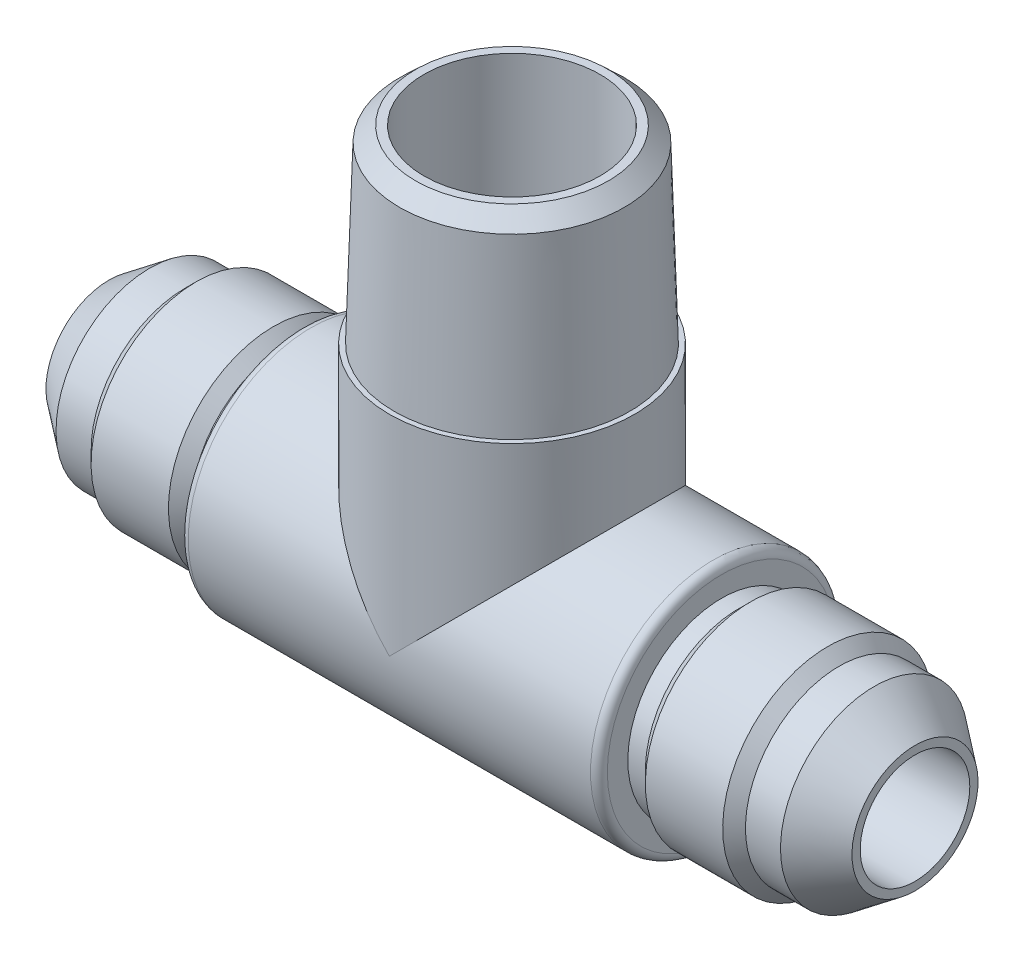
ISO-10303-21;
HEADER;
FILE_DESCRIPTION(('STEP AP214'),'2;1');
FILE_NAME('part.step','',(''),(''),'','','');
FILE_SCHEMA(('AUTOMOTIVE_DESIGN { 1 0 10303 214 1 1 1 1 }'));
ENDSEC;
DATA;
#1=APPLICATION_CONTEXT('core data for automotive mechanical design processes');
#2=APPLICATION_PROTOCOL_DEFINITION('international standard','automotive_design',2000,#1);
#3=PRODUCT_CONTEXT('',#1,'mechanical');
#4=PRODUCT('Part','Part','',(#3));
#5=PRODUCT_RELATED_PRODUCT_CATEGORY('part','',(#4));
#6=PRODUCT_DEFINITION_FORMATION('','',#4);
#7=PRODUCT_DEFINITION_CONTEXT('part definition',#1,'design');
#8=PRODUCT_DEFINITION('design','',#6,#7);
#9=PRODUCT_DEFINITION_SHAPE('','',#8);
#10=(LENGTH_UNIT() NAMED_UNIT(*) SI_UNIT(.MILLI.,.METRE.));
#11=(NAMED_UNIT(*) PLANE_ANGLE_UNIT() SI_UNIT($,.RADIAN.));
#12=(NAMED_UNIT(*) SI_UNIT($,.STERADIAN.) SOLID_ANGLE_UNIT());
#13=UNCERTAINTY_MEASURE_WITH_UNIT(LENGTH_MEASURE(1.E-05),#10,'distance_accuracy_value','');
#14=(GEOMETRIC_REPRESENTATION_CONTEXT(3) GLOBAL_UNCERTAINTY_ASSIGNED_CONTEXT((#13)) GLOBAL_UNIT_ASSIGNED_CONTEXT((#10,
#11,#12)) REPRESENTATION_CONTEXT('',''));
#15=CARTESIAN_POINT('',(0.,0.,0.));
#16=DIRECTION('',(0.,0.,1.));
#17=DIRECTION('',(1.,0.,0.));
#18=AXIS2_PLACEMENT_3D('',#15,#16,#17);
#19=CARTESIAN_POINT('',(-36.5125,0.,0.));
#20=DIRECTION('',(1.,0.,0.));
#21=DIRECTION('',(0.,0.,-1.));
#22=AXIS2_PLACEMENT_3D('',#19,#20,#21);
#23=CYLINDRICAL_SURFACE('',#22,4.9657);
#24=CARTESIAN_POINT('',(36.5125,-2.5496542476902E-13,0.));
#25=DIRECTION('',(-1.,0.,0.));
#26=DIRECTION('',(0.,0.,-1.));
#27=AXIS2_PLACEMENT_3D('',#24,#25,#26);
#28=CIRCLE('',#27,4.9657);
#29=CARTESIAN_POINT('',(36.5125,-2.5496542476902E-13,-4.9657));
#30=VERTEX_POINT('',#29);
#31=EDGE_CURVE('E71',#30,#30,#28,.T.);
#32=ORIENTED_EDGE('',*,*,#31,.F.);
#33=EDGE_LOOP('',(#32));
#34=FACE_BOUND('',#33,.T.);
#35=CARTESIAN_POINT('',(-36.5125,0.,0.));
#36=DIRECTION('',(1.,0.,0.));
#37=DIRECTION('',(0.,0.,-1.));
#38=AXIS2_PLACEMENT_3D('',#35,#36,#37);
#39=CIRCLE('',#38,4.9657);
#40=CARTESIAN_POINT('',(-36.5125,0.,-4.9657));
#41=VERTEX_POINT('',#40);
#42=EDGE_CURVE('E124',#41,#41,#39,.T.);
#43=ORIENTED_EDGE('',*,*,#42,.F.);
#44=EDGE_LOOP('',(#43));
#45=FACE_BOUND('',#44,.T.);
#46=CARTESIAN_POINT('',(0.,0.,0.));
#47=DIRECTION('',(0.707106781186547,-0.707106781186547,0.));
#48=DIRECTION('',(0.707106781186547,0.707106781186547,0.));
#49=AXIS2_PLACEMENT_3D('',#46,#47,#48);
#50=ELLIPSE('',#49,7.02256028667608,4.9657);
#51=CARTESIAN_POINT('',(0.,0.,-4.9657));
#52=VERTEX_POINT('',#51);
#53=CARTESIAN_POINT('',(0.,0.,4.9657));
#54=VERTEX_POINT('',#53);
#55=EDGE_CURVE('E55',#52,#54,#50,.T.);
#56=ORIENTED_EDGE('',*,*,#55,.F.);
#57=CARTESIAN_POINT('',(0.,0.,0.));
#58=DIRECTION('',(0.707106781186547,0.707106781186547,0.));
#59=DIRECTION('',(0.707106781186547,-0.707106781186547,0.));
#60=AXIS2_PLACEMENT_3D('',#57,#58,#59);
#61=ELLIPSE('',#60,7.02256028667608,4.9657);
#62=EDGE_CURVE('E67',#54,#52,#61,.F.);
#63=ORIENTED_EDGE('',*,*,#62,.F.);
#64=EDGE_LOOP('',(#56,#63));
#65=FACE_BOUND('',#64,.T.);
#66=ADVANCED_FACE('F40',(#34,#45,#65),#23,.F.);
#67=CARTESIAN_POINT('',(0.,18.9865,0.));
#68=DIRECTION('',(0.,1.,0.));
#69=DIRECTION('',(0.,0.,1.));
#70=AXIS2_PLACEMENT_3D('',#67,#68,#69);
#71=PLANE('',#70);
#72=CARTESIAN_POINT('',(0.,18.9865,0.));
#73=DIRECTION('',(0.,1.,0.));
#74=DIRECTION('',(0.,0.,1.));
#75=AXIS2_PLACEMENT_3D('',#72,#73,#74);
#76=CIRCLE('',#75,7.9783854550759);
#77=CARTESIAN_POINT('',(0.,18.9865,7.9783854550759));
#78=VERTEX_POINT('',#77);
#79=EDGE_CURVE('E112',#78,#78,#76,.T.);
#80=ORIENTED_EDGE('',*,*,#79,.T.);
#81=EDGE_LOOP('',(#80));
#82=FACE_BOUND('',#81,.T.);
#83=CARTESIAN_POINT('',(0.,18.9865,0.));
#84=DIRECTION('',(0.,1.,0.));
#85=DIRECTION('',(0.,0.,1.));
#86=AXIS2_PLACEMENT_3D('',#83,#84,#85);
#87=CIRCLE('',#86,4.9657);
#88=CARTESIAN_POINT('',(0.,18.9865,4.9657));
#89=VERTEX_POINT('',#88);
#90=EDGE_CURVE('E44',#89,#89,#87,.F.);
#91=ORIENTED_EDGE('',*,*,#90,.T.);
#92=EDGE_LOOP('',(#91));
#93=FACE_BOUND('',#92,.T.);
#94=ADVANCED_FACE('F168',(#82,#93),#71,.T.);
#95=CARTESIAN_POINT('',(-18.9865,0.,0.));
#96=DIRECTION('',(-1.,0.,0.));
#97=DIRECTION('',(0.,0.,1.));
#98=AXIS2_PLACEMENT_3D('',#95,#96,#97);
#99=CYLINDRICAL_SURFACE('',#98,9.525);
#100=CARTESIAN_POINT('',(-21.6051114963808,0.,0.));
#101=DIRECTION('',(1.,0.,0.));
#102=DIRECTION('',(0.,1.,0.));
#103=AXIS2_PLACEMENT_3D('',#100,#101,#102);
#104=CIRCLE('',#103,9.52500000000001);
#105=CARTESIAN_POINT('',(-21.6051114963808,9.525,0.));
#106=VERTEX_POINT('',#105);
#107=EDGE_CURVE('E127',#106,#106,#104,.T.);
#108=ORIENTED_EDGE('',*,*,#107,.F.);
#109=EDGE_LOOP('',(#108));
#110=FACE_BOUND('',#109,.T.);
#111=CARTESIAN_POINT('',(-28.6127801907987,0.,0.));
#112=DIRECTION('',(1.,0.,0.));
#113=DIRECTION('',(0.,1.,0.));
#114=AXIS2_PLACEMENT_3D('',#111,#112,#113);
#115=CIRCLE('',#114,9.52500000000001);
#116=CARTESIAN_POINT('',(-28.6127801907987,9.525,0.));
#117=VERTEX_POINT('',#116);
#118=EDGE_CURVE('E136',#117,#117,#115,.T.);
#119=ORIENTED_EDGE('',*,*,#118,.T.);
#120=EDGE_LOOP('',(#119));
#121=FACE_BOUND('',#120,.T.);
#122=ADVANCED_FACE('F174',(#110,#121),#99,.T.);
#123=CARTESIAN_POINT('',(-29.6438916871796,0.,0.));
#124=DIRECTION('',(1.,0.,0.));
#125=DIRECTION('',(0.,1.,0.));
#126=AXIS2_PLACEMENT_3D('',#123,#124,#125);
#127=CONICAL_SURFACE('',#126,8.49388850361916,0.78539816339745);
#128=ORIENTED_EDGE('',*,*,#118,.F.);
#129=EDGE_LOOP('',(#128));
#130=FACE_BOUND('',#129,.T.);
#131=CARTESIAN_POINT('',(-29.6438916871796,0.,0.));
#132=DIRECTION('',(1.,0.,0.));
#133=DIRECTION('',(0.,1.,0.));
#134=AXIS2_PLACEMENT_3D('',#131,#132,#133);
#135=CIRCLE('',#134,8.49388850361916);
#136=CARTESIAN_POINT('',(-29.6438916871796,8.49388850361916,0.));
#137=VERTEX_POINT('',#136);
#138=EDGE_CURVE('E145',#137,#137,#135,.T.);
#139=ORIENTED_EDGE('',*,*,#138,.T.);
#140=EDGE_LOOP('',(#139));
#141=FACE_BOUND('',#140,.T.);
#142=ADVANCED_FACE('F203',(#130,#141),#127,.T.);
#143=CARTESIAN_POINT('',(0.,0.,0.));
#144=DIRECTION('',(1.,0.,0.));
#145=DIRECTION('',(0.,1.,0.));
#146=AXIS2_PLACEMENT_3D('',#143,#144,#145);
#147=CYLINDRICAL_SURFACE('',#146,8.49388850361916);
#148=ORIENTED_EDGE('',*,*,#138,.F.);
#149=EDGE_LOOP('',(#148));
#150=FACE_BOUND('',#149,.T.);
#151=CARTESIAN_POINT('',(-32.8188916871796,0.,0.));
#152=DIRECTION('',(1.,0.,0.));
#153=DIRECTION('',(0.,1.,0.));
#154=AXIS2_PLACEMENT_3D('',#151,#152,#153);
#155=CIRCLE('',#154,8.49388850361916);
#156=CARTESIAN_POINT('',(-32.8188916871796,8.49388850361916,0.));
#157=VERTEX_POINT('',#156);
#158=EDGE_CURVE('E142',#157,#157,#155,.T.);
#159=ORIENTED_EDGE('',*,*,#158,.T.);
#160=EDGE_LOOP('',(#159));
#161=FACE_BOUND('',#160,.T.);
#162=ADVANCED_FACE('F199',(#150,#161),#147,.T.);
#163=CARTESIAN_POINT('',(-36.5125,0.,0.));
#164=DIRECTION('',(1.,0.,0.));
#165=DIRECTION('',(0.,1.,0.));
#166=AXIS2_PLACEMENT_3D('',#163,#164,#165);
#167=CONICAL_SURFACE('',#166,5.71055500000001,0.645771823237897);
#168=ORIENTED_EDGE('',*,*,#158,.F.);
#169=EDGE_LOOP('',(#168));
#170=FACE_BOUND('',#169,.T.);
#171=CARTESIAN_POINT('',(-36.5125,0.,0.));
#172=DIRECTION('',(1.,0.,0.));
#173=DIRECTION('',(0.,1.,0.));
#174=AXIS2_PLACEMENT_3D('',#171,#172,#173);
#175=CIRCLE('',#174,5.71055500000001);
#176=CARTESIAN_POINT('',(-36.5125,5.710555,0.));
#177=VERTEX_POINT('',#176);
#178=EDGE_CURVE('E139',#177,#177,#175,.T.);
#179=ORIENTED_EDGE('',*,*,#178,.T.);
#180=EDGE_LOOP('',(#179));
#181=FACE_BOUND('',#180,.T.);
#182=ADVANCED_FACE('F196',(#170,#181),#167,.T.);
#183=CARTESIAN_POINT('',(-36.5125,0.,0.));
#184=DIRECTION('',(1.,0.,0.));
#185=DIRECTION('',(0.,0.,-1.));
#186=AXIS2_PLACEMENT_3D('',#183,#184,#185);
#187=PLANE('',#186);
#188=ORIENTED_EDGE('',*,*,#42,.T.);
#189=EDGE_LOOP('',(#188));
#190=FACE_BOUND('',#189,.T.);
#191=ORIENTED_EDGE('',*,*,#178,.F.);
#192=EDGE_LOOP('',(#191));
#193=FACE_BOUND('',#192,.T.);
#194=ADVANCED_FACE('F194',(#190,#193),#187,.F.);
#195=CARTESIAN_POINT('',(0.,0.,0.));
#196=DIRECTION('',(1.,0.,0.));
#197=DIRECTION('',(0.,1.,0.));
#198=AXIS2_PLACEMENT_3D('',#195,#196,#197);
#199=CYLINDRICAL_SURFACE('',#198,8.49388850361916);
#200=CARTESIAN_POINT('',(-18.9865,0.,0.));
#201=DIRECTION('',(1.,0.,0.));
#202=DIRECTION('',(0.,1.,0.));
#203=AXIS2_PLACEMENT_3D('',#200,#201,#202);
#204=CIRCLE('',#203,8.49388850361916);
#205=CARTESIAN_POINT('',(-18.9865,8.49388850361916,0.));
#206=VERTEX_POINT('',#205);
#207=EDGE_CURVE('E133',#206,#206,#204,.T.);
#208=ORIENTED_EDGE('',*,*,#207,.F.);
#209=EDGE_LOOP('',(#208));
#210=FACE_BOUND('',#209,.T.);
#211=CARTESIAN_POINT('',(-20.574,0.,0.));
#212=DIRECTION('',(1.,0.,0.));
#213=DIRECTION('',(0.,1.,0.));
#214=AXIS2_PLACEMENT_3D('',#211,#212,#213);
#215=CIRCLE('',#214,8.49388850361916);
#216=CARTESIAN_POINT('',(-20.574,8.49388850361916,0.));
#217=VERTEX_POINT('',#216);
#218=EDGE_CURVE('E130',#217,#217,#215,.T.);
#219=ORIENTED_EDGE('',*,*,#218,.T.);
#220=EDGE_LOOP('',(#219));
#221=FACE_BOUND('',#220,.T.);
#222=ADVANCED_FACE('F190',(#210,#221),#199,.T.);
#223=CARTESIAN_POINT('',(-21.6051114963808,0.,0.));
#224=DIRECTION('',(-1.,0.,0.));
#225=DIRECTION('',(0.,-1.,0.));
#226=AXIS2_PLACEMENT_3D('',#223,#224,#225);
#227=CONICAL_SURFACE('',#226,9.52500000000001,0.785398163397452);
#228=ORIENTED_EDGE('',*,*,#218,.F.);
#229=EDGE_LOOP('',(#228));
#230=FACE_BOUND('',#229,.T.);
#231=ORIENTED_EDGE('',*,*,#107,.T.);
#232=EDGE_LOOP('',(#231));
#233=FACE_BOUND('',#232,.T.);
#234=ADVANCED_FACE('F185',(#230,#233),#227,.T.);
#235=CARTESIAN_POINT('',(-18.9865,0.,0.));
#236=DIRECTION('',(1.,0.,0.));
#237=DIRECTION('',(0.,0.,-1.));
#238=AXIS2_PLACEMENT_3D('',#235,#236,#237);
#239=PLANE('',#238);
#240=CARTESIAN_POINT('',(-18.9865,0.,0.));
#241=DIRECTION('',(1.,0.,0.));
#242=DIRECTION('',(0.,0.,-1.));
#243=AXIS2_PLACEMENT_3D('',#240,#241,#242);
#244=CIRCLE('',#243,10.3505);
#245=CARTESIAN_POINT('',(-18.9865,0.,-10.3505));
#246=VERTEX_POINT('',#245);
#247=EDGE_CURVE('E11',#246,#246,#244,.F.);
#248=ORIENTED_EDGE('',*,*,#247,.T.);
#249=EDGE_LOOP('',(#248));
#250=FACE_BOUND('',#249,.T.);
#251=ORIENTED_EDGE('',*,*,#207,.T.);
#252=EDGE_LOOP('',(#251));
#253=FACE_BOUND('',#252,.T.);
#254=ADVANCED_FACE('F164',(#250,#253),#239,.F.);
#255=CARTESIAN_POINT('',(0.,0.,0.));
#256=DIRECTION('',(-1.,0.,0.));
#257=DIRECTION('',(0.,0.,1.));
#258=AXIS2_PLACEMENT_3D('',#255,#256,#257);
#259=CYLINDRICAL_SURFACE('',#258,11.1125);
#260=CARTESIAN_POINT('',(-18.2245,0.,0.));
#261=DIRECTION('',(1.,0.,0.));
#262=DIRECTION('',(0.,0.,-1.));
#263=AXIS2_PLACEMENT_3D('',#260,#261,#262);
#264=CIRCLE('',#263,11.1125);
#265=CARTESIAN_POINT('',(-18.2245,0.,-11.1125));
#266=VERTEX_POINT('',#265);
#267=EDGE_CURVE('E49',#266,#266,#264,.T.);
#268=ORIENTED_EDGE('',*,*,#267,.T.);
#269=EDGE_LOOP('',(#268));
#270=FACE_BOUND('',#269,.T.);
#271=CARTESIAN_POINT('',(0.,0.,0.));
#272=DIRECTION('',(-0.707106781186547,-0.707106781186547,0.));
#273=DIRECTION('',(-0.707106781186547,0.707106781186547,0.));
#274=AXIS2_PLACEMENT_3D('',#271,#272,#273);
#275=ELLIPSE('',#274,15.715448211871,11.1125);
#276=CARTESIAN_POINT('',(0.,0.,11.1125));
#277=VERTEX_POINT('',#276);
#278=CARTESIAN_POINT('',(0.,0.,-11.1125));
#279=VERTEX_POINT('',#278);
#280=EDGE_CURVE('E62',#277,#279,#275,.T.);
#281=ORIENTED_EDGE('',*,*,#280,.T.);
#282=CARTESIAN_POINT('',(0.,0.,0.));
#283=DIRECTION('',(-0.707106781186545,0.70710678118655,0.));
#284=DIRECTION('',(0.70710678118655,0.707106781186545,0.));
#285=AXIS2_PLACEMENT_3D('',#282,#283,#284);
#286=ELLIPSE('',#285,15.715448211871,11.1125);
#287=EDGE_CURVE('E103',#277,#279,#286,.T.);
#288=ORIENTED_EDGE('',*,*,#287,.F.);
#289=EDGE_LOOP('',(#281,#288));
#290=FACE_BOUND('',#289,.T.);
#291=CARTESIAN_POINT('',(18.2245,-1.2379155636754E-13,0.));
#292=DIRECTION('',(-1.,0.,0.));
#293=DIRECTION('',(0.,0.,-1.));
#294=AXIS2_PLACEMENT_3D('',#291,#292,#293);
#295=CIRCLE('',#294,11.1125);
#296=CARTESIAN_POINT('',(18.2245,-1.2379155636754E-13,-11.1125));
#297=VERTEX_POINT('',#296);
#298=EDGE_CURVE('E97',#297,#297,#295,.T.);
#299=ORIENTED_EDGE('',*,*,#298,.T.);
#300=EDGE_LOOP('',(#299));
#301=FACE_BOUND('',#300,.T.);
#302=ADVANCED_FACE('F151',(#270,#290,#301),#259,.T.);
#303=CARTESIAN_POINT('',(-18.2245,0.,0.));
#304=DIRECTION('',(1.,0.,0.));
#305=DIRECTION('',(0.,0.,-1.));
#306=AXIS2_PLACEMENT_3D('',#303,#304,#305);
#307=TOROIDAL_SURFACE('',#306,10.3505,0.762);
#308=ORIENTED_EDGE('',*,*,#247,.F.);
#309=EDGE_LOOP('',(#308));
#310=FACE_BOUND('',#309,.T.);
#311=ORIENTED_EDGE('',*,*,#267,.F.);
#312=EDGE_LOOP('',(#311));
#313=FACE_BOUND('',#312,.T.);
#314=ADVANCED_FACE('F42',(#310,#313),#307,.T.);
#315=CARTESIAN_POINT('',(0.,0.,0.));
#316=DIRECTION('',(0.,1.,0.));
#317=DIRECTION('',(0.,0.,1.));
#318=AXIS2_PLACEMENT_3D('',#315,#316,#317);
#319=CYLINDRICAL_SURFACE('',#318,11.1125);
#320=CARTESIAN_POINT('',(0.,18.9865,0.));
#321=DIRECTION('',(0.,1.,0.));
#322=DIRECTION('',(0.,0.,1.));
#323=AXIS2_PLACEMENT_3D('',#320,#321,#322);
#324=CIRCLE('',#323,11.1125);
#325=CARTESIAN_POINT('',(0.,18.9865,11.1125));
#326=VERTEX_POINT('',#325);
#327=EDGE_CURVE('E105',#326,#326,#324,.T.);
#328=ORIENTED_EDGE('',*,*,#327,.F.);
#329=EDGE_LOOP('',(#328));
#330=FACE_BOUND('',#329,.T.);
#331=ORIENTED_EDGE('',*,*,#280,.F.);
#332=ORIENTED_EDGE('',*,*,#287,.T.);
#333=EDGE_LOOP('',(#331,#332));
#334=FACE_BOUND('',#333,.T.);
#335=ADVANCED_FACE('F155',(#330,#334),#319,.T.);
#336=CARTESIAN_POINT('',(0.,18.9865,0.));
#337=DIRECTION('',(0.,-1.,0.));
#338=DIRECTION('',(0.,0.,1.));
#339=AXIS2_PLACEMENT_3D('',#336,#337,#338);
#340=CONICAL_SURFACE('',#339,10.668,0.0305432619099008);
#341=CARTESIAN_POINT('',(0.,34.7561803638972,0.));
#342=DIRECTION('',(0.,-1.,0.));
#343=DIRECTION('',(0.,0.,-1.));
#344=AXIS2_PLACEMENT_3D('',#341,#342,#343);
#345=CIRCLE('',#344,10.1861926885474);
#346=CARTESIAN_POINT('',(0.,34.7561803638972,-10.1861926885474));
#347=VERTEX_POINT('',#346);
#348=EDGE_CURVE('E120',#347,#347,#345,.T.);
#349=ORIENTED_EDGE('',*,*,#348,.T.);
#350=EDGE_LOOP('',(#349));
#351=FACE_BOUND('',#350,.T.);
#352=CARTESIAN_POINT('',(0.,18.9865,0.));
#353=DIRECTION('',(0.,1.,0.));
#354=DIRECTION('',(0.,0.,1.));
#355=AXIS2_PLACEMENT_3D('',#352,#353,#354);
#356=CIRCLE('',#355,10.668);
#357=CARTESIAN_POINT('',(0.,18.9865,10.668));
#358=VERTEX_POINT('',#357);
#359=EDGE_CURVE('E108',#358,#358,#356,.T.);
#360=ORIENTED_EDGE('',*,*,#359,.T.);
#361=EDGE_LOOP('',(#360));
#362=FACE_BOUND('',#361,.T.);
#363=ADVANCED_FACE('F161',(#351,#362),#340,.T.);
#364=CARTESIAN_POINT('',(0.,36.11626,0.));
#365=DIRECTION('',(0.,1.,0.));
#366=DIRECTION('',(0.,0.,1.));
#367=AXIS2_PLACEMENT_3D('',#364,#365,#366);
#368=PLANE('',#367);
#369=CARTESIAN_POINT('',(0.,36.11626,0.));
#370=DIRECTION('',(0.,1.,0.));
#371=DIRECTION('',(0.,0.,1.));
#372=AXIS2_PLACEMENT_3D('',#369,#370,#371);
#373=CIRCLE('',#372,7.9783854550759);
#374=CARTESIAN_POINT('',(0.,36.11626,7.9783854550759));
#375=VERTEX_POINT('',#374);
#376=EDGE_CURVE('E111',#375,#375,#373,.T.);
#377=ORIENTED_EDGE('',*,*,#376,.F.);
#378=EDGE_LOOP('',(#377));
#379=FACE_BOUND('',#378,.T.);
#380=CARTESIAN_POINT('',(0.,36.11626,0.));
#381=DIRECTION('',(0.,1.,0.));
#382=DIRECTION('',(0.,0.,1.));
#383=AXIS2_PLACEMENT_3D('',#380,#381,#382);
#384=CIRCLE('',#383,8.7403854550759);
#385=CARTESIAN_POINT('',(0.,36.11626,8.7403854550759));
#386=VERTEX_POINT('',#385);
#387=EDGE_CURVE('E115',#386,#386,#384,.T.);
#388=ORIENTED_EDGE('',*,*,#387,.T.);
#389=EDGE_LOOP('',(#388));
#390=FACE_BOUND('',#389,.T.);
#391=ADVANCED_FACE('F282',(#379,#390),#368,.T.);
#392=CARTESIAN_POINT('',(0.,36.11626,0.));
#393=DIRECTION('',(0.,-1.,0.));
#394=DIRECTION('',(0.,0.,-1.));
#395=AXIS2_PLACEMENT_3D('',#392,#393,#394);
#396=CONICAL_SURFACE('',#395,8.7403854550759,0.815941425307345);
#397=ORIENTED_EDGE('',*,*,#348,.F.);
#398=EDGE_LOOP('',(#397));
#399=FACE_BOUND('',#398,.T.);
#400=ORIENTED_EDGE('',*,*,#387,.F.);
#401=EDGE_LOOP('',(#400));
#402=FACE_BOUND('',#401,.T.);
#403=ADVANCED_FACE('F182',(#399,#402),#396,.T.);
#404=CARTESIAN_POINT('',(0.,18.9865,0.));
#405=DIRECTION('',(0.,1.,0.));
#406=DIRECTION('',(0.,0.,1.));
#407=AXIS2_PLACEMENT_3D('',#404,#405,#406);
#408=CYLINDRICAL_SURFACE('',#407,7.9783854550759);
#409=ORIENTED_EDGE('',*,*,#79,.F.);
#410=EDGE_LOOP('',(#409));
#411=FACE_BOUND('',#410,.T.);
#412=ORIENTED_EDGE('',*,*,#376,.T.);
#413=EDGE_LOOP('',(#412));
#414=FACE_BOUND('',#413,.T.);
#415=ADVANCED_FACE('F299',(#411,#414),#408,.F.);
#416=ORIENTED_EDGE('',*,*,#327,.T.);
#417=EDGE_LOOP('',(#416));
#418=FACE_BOUND('',#417,.T.);
#419=ORIENTED_EDGE('',*,*,#359,.F.);
#420=EDGE_LOOP('',(#419));
#421=FACE_BOUND('',#420,.T.);
#422=ADVANCED_FACE('F177',(#418,#421),#71,.T.);
#423=CARTESIAN_POINT('',(18.9865,-1.3258202087989E-13,0.));
#424=DIRECTION('',(1.,0.,0.));
#425=DIRECTION('',(0.,0.,1.));
#426=AXIS2_PLACEMENT_3D('',#423,#424,#425);
#427=CYLINDRICAL_SURFACE('',#426,9.525);
#428=CARTESIAN_POINT('',(21.6051114963808,-1.47906723322083E-13,0.));
#429=DIRECTION('',(-1.,0.,0.));
#430=DIRECTION('',(0.,-1.,0.));
#431=AXIS2_PLACEMENT_3D('',#428,#429,#430);
#432=CIRCLE('',#431,9.52500000000001);
#433=CARTESIAN_POINT('',(21.6051114963808,-9.52500000000015,0.));
#434=VERTEX_POINT('',#433);
#435=EDGE_CURVE('E74',#434,#434,#432,.T.);
#436=ORIENTED_EDGE('',*,*,#435,.F.);
#437=EDGE_LOOP('',(#436));
#438=FACE_BOUND('',#437,.T.);
#439=CARTESIAN_POINT('',(28.6127801907987,-1.95880616670965E-13,0.));
#440=DIRECTION('',(-1.,0.,0.));
#441=DIRECTION('',(0.,-1.,0.));
#442=AXIS2_PLACEMENT_3D('',#439,#440,#441);
#443=CIRCLE('',#442,9.52500000000001);
#444=CARTESIAN_POINT('',(28.6127801907987,-9.5250000000002,0.));
#445=VERTEX_POINT('',#444);
#446=EDGE_CURVE('E85',#445,#445,#443,.T.);
#447=ORIENTED_EDGE('',*,*,#446,.T.);
#448=EDGE_LOOP('',(#447));
#449=FACE_BOUND('',#448,.T.);
#450=ADVANCED_FACE('F317',(#438,#449),#427,.T.);
#451=CARTESIAN_POINT('',(29.6438916871796,-2.02939516729637E-13,0.));
#452=DIRECTION('',(-1.,0.,0.));
#453=DIRECTION('',(0.,-1.,0.));
#454=AXIS2_PLACEMENT_3D('',#451,#452,#453);
#455=CONICAL_SURFACE('',#454,8.49388850361916,0.78539816339745);
#456=ORIENTED_EDGE('',*,*,#446,.F.);
#457=EDGE_LOOP('',(#456));
#458=FACE_BOUND('',#457,.T.);
#459=CARTESIAN_POINT('',(29.6438916871796,-2.02939516729637E-13,0.));
#460=DIRECTION('',(-1.,0.,0.));
#461=DIRECTION('',(0.,-1.,0.));
#462=AXIS2_PLACEMENT_3D('',#459,#460,#461);
#463=CIRCLE('',#462,8.49388850361916);
#464=CARTESIAN_POINT('',(29.6438916871795,-8.49388850361936,0.));
#465=VERTEX_POINT('',#464);
#466=EDGE_CURVE('E94',#465,#465,#463,.T.);
#467=ORIENTED_EDGE('',*,*,#466,.T.);
#468=EDGE_LOOP('',(#467));
#469=FACE_BOUND('',#468,.T.);
#470=ADVANCED_FACE('F327',(#458,#469),#455,.T.);
#471=CARTESIAN_POINT('',(0.,0.,0.));
#472=DIRECTION('',(-1.,0.,0.));
#473=DIRECTION('',(0.,-1.,0.));
#474=AXIS2_PLACEMENT_3D('',#471,#472,#473);
#475=CYLINDRICAL_SURFACE('',#474,8.49388850361916);
#476=ORIENTED_EDGE('',*,*,#466,.F.);
#477=EDGE_LOOP('',(#476));
#478=FACE_BOUND('',#477,.T.);
#479=CARTESIAN_POINT('',(32.8188916871796,-2.24675291924608E-13,0.));
#480=DIRECTION('',(-1.,0.,0.));
#481=DIRECTION('',(0.,-1.,0.));
#482=AXIS2_PLACEMENT_3D('',#479,#480,#481);
#483=CIRCLE('',#482,8.49388850361916);
#484=CARTESIAN_POINT('',(32.8188916871795,-8.49388850361939,0.));
#485=VERTEX_POINT('',#484);
#486=EDGE_CURVE('E91',#485,#485,#483,.T.);
#487=ORIENTED_EDGE('',*,*,#486,.T.);
#488=EDGE_LOOP('',(#487));
#489=FACE_BOUND('',#488,.T.);
#490=ADVANCED_FACE('F337',(#478,#489),#475,.T.);
#491=CARTESIAN_POINT('',(36.5125,-2.49961414742164E-13,0.));
#492=DIRECTION('',(-1.,0.,0.));
#493=DIRECTION('',(0.,-1.,0.));
#494=AXIS2_PLACEMENT_3D('',#491,#492,#493);
#495=CONICAL_SURFACE('',#494,5.71055500000001,0.645771823237897);
#496=ORIENTED_EDGE('',*,*,#486,.F.);
#497=EDGE_LOOP('',(#496));
#498=FACE_BOUND('',#497,.T.);
#499=CARTESIAN_POINT('',(36.5125,-2.49961414742164E-13,0.));
#500=DIRECTION('',(-1.,0.,0.));
#501=DIRECTION('',(0.,-1.,0.));
#502=AXIS2_PLACEMENT_3D('',#499,#500,#501);
#503=CIRCLE('',#502,5.71055500000001);
#504=CARTESIAN_POINT('',(36.5125,-5.71055500000026,0.));
#505=VERTEX_POINT('',#504);
#506=EDGE_CURVE('E88',#505,#505,#503,.T.);
#507=ORIENTED_EDGE('',*,*,#506,.T.);
#508=EDGE_LOOP('',(#507));
#509=FACE_BOUND('',#508,.T.);
#510=ADVANCED_FACE('F346',(#498,#509),#495,.T.);
#511=CARTESIAN_POINT('',(36.5125,-2.5496542476902E-13,0.));
#512=DIRECTION('',(-1.,0.,0.));
#513=DIRECTION('',(0.,0.,-1.));
#514=AXIS2_PLACEMENT_3D('',#511,#512,#513);
#515=PLANE('',#514);
#516=ORIENTED_EDGE('',*,*,#31,.T.);
#517=EDGE_LOOP('',(#516));
#518=FACE_BOUND('',#517,.T.);
#519=ORIENTED_EDGE('',*,*,#506,.F.);
#520=EDGE_LOOP('',(#519));
#521=FACE_BOUND('',#520,.T.);
#522=ADVANCED_FACE('F355',(#518,#521),#515,.F.);
#523=CARTESIAN_POINT('',(0.,0.,0.));
#524=DIRECTION('',(-1.,0.,0.));
#525=DIRECTION('',(0.,-1.,0.));
#526=AXIS2_PLACEMENT_3D('',#523,#524,#525);
#527=CYLINDRICAL_SURFACE('',#526,8.49388850361916);
#528=CARTESIAN_POINT('',(18.9865,-1.29979935665925E-13,0.));
#529=DIRECTION('',(-1.,0.,0.));
#530=DIRECTION('',(0.,-1.,0.));
#531=AXIS2_PLACEMENT_3D('',#528,#529,#530);
#532=CIRCLE('',#531,8.49388850361916);
#533=CARTESIAN_POINT('',(18.9864999999999,-8.49388850361929,0.));
#534=VERTEX_POINT('',#533);
#535=EDGE_CURVE('E82',#534,#534,#532,.T.);
#536=ORIENTED_EDGE('',*,*,#535,.F.);
#537=EDGE_LOOP('',(#536));
#538=FACE_BOUND('',#537,.T.);
#539=CARTESIAN_POINT('',(20.574,-1.4084782326341E-13,0.));
#540=DIRECTION('',(-1.,0.,0.));
#541=DIRECTION('',(0.,-1.,0.));
#542=AXIS2_PLACEMENT_3D('',#539,#540,#541);
#543=CIRCLE('',#542,8.49388850361916);
#544=CARTESIAN_POINT('',(20.5739999999999,-8.4938885036193,0.));
#545=VERTEX_POINT('',#544);
#546=EDGE_CURVE('E79',#545,#545,#543,.T.);
#547=ORIENTED_EDGE('',*,*,#546,.T.);
#548=EDGE_LOOP('',(#547));
#549=FACE_BOUND('',#548,.T.);
#550=ADVANCED_FACE('F364',(#538,#549),#527,.T.);
#551=CARTESIAN_POINT('',(21.6051114963808,-1.47906723322083E-13,0.));
#552=DIRECTION('',(1.,0.,0.));
#553=DIRECTION('',(0.,1.,0.));
#554=AXIS2_PLACEMENT_3D('',#551,#552,#553);
#555=CONICAL_SURFACE('',#554,9.52500000000001,0.785398163397452);
#556=ORIENTED_EDGE('',*,*,#546,.F.);
#557=EDGE_LOOP('',(#556));
#558=FACE_BOUND('',#557,.T.);
#559=ORIENTED_EDGE('',*,*,#435,.T.);
#560=EDGE_LOOP('',(#559));
#561=FACE_BOUND('',#560,.T.);
#562=ADVANCED_FACE('F373',(#558,#561),#555,.T.);
#563=CARTESIAN_POINT('',(18.9865,-1.29112573927937E-13,0.));
#564=DIRECTION('',(-1.,0.,0.));
#565=DIRECTION('',(0.,0.,-1.));
#566=AXIS2_PLACEMENT_3D('',#563,#564,#565);
#567=PLANE('',#566);
#568=CARTESIAN_POINT('',(18.9865,-1.29112573927937E-13,0.));
#569=DIRECTION('',(-1.,0.,0.));
#570=DIRECTION('',(0.,0.,-1.));
#571=AXIS2_PLACEMENT_3D('',#568,#569,#570);
#572=CIRCLE('',#571,10.3505);
#573=CARTESIAN_POINT('',(18.9865,-1.29112573927937E-13,-10.3505));
#574=VERTEX_POINT('',#573);
#575=EDGE_CURVE('E100',#574,#574,#572,.F.);
#576=ORIENTED_EDGE('',*,*,#575,.T.);
#577=EDGE_LOOP('',(#576));
#578=FACE_BOUND('',#577,.T.);
#579=ORIENTED_EDGE('',*,*,#535,.T.);
#580=EDGE_LOOP('',(#579));
#581=FACE_BOUND('',#580,.T.);
#582=ADVANCED_FACE('F382',(#578,#581),#567,.F.);
#583=CARTESIAN_POINT('',(18.2245,-1.2379155636754E-13,0.));
#584=DIRECTION('',(-1.,0.,0.));
#585=DIRECTION('',(0.,0.,-1.));
#586=AXIS2_PLACEMENT_3D('',#583,#584,#585);
#587=TOROIDAL_SURFACE('',#586,10.3505,0.762);
#588=ORIENTED_EDGE('',*,*,#575,.F.);
#589=EDGE_LOOP('',(#588));
#590=FACE_BOUND('',#589,.T.);
#591=ORIENTED_EDGE('',*,*,#298,.F.);
#592=EDGE_LOOP('',(#591));
#593=FACE_BOUND('',#592,.T.);
#594=ADVANCED_FACE('F391',(#590,#593),#587,.T.);
#595=CARTESIAN_POINT('',(0.,36.11626,0.));
#596=DIRECTION('',(0.,-1.,0.));
#597=DIRECTION('',(0.,0.,-1.));
#598=AXIS2_PLACEMENT_3D('',#595,#596,#597);
#599=CYLINDRICAL_SURFACE('',#598,4.9657);
#600=ORIENTED_EDGE('',*,*,#90,.F.);
#601=EDGE_LOOP('',(#600));
#602=FACE_BOUND('',#601,.T.);
#603=ORIENTED_EDGE('',*,*,#55,.T.);
#604=ORIENTED_EDGE('',*,*,#62,.T.);
#605=EDGE_LOOP('',(#603,#604));
#606=FACE_BOUND('',#605,.T.);
#607=ADVANCED_FACE('F68',(#602,#606),#599,.F.);
#608=CLOSED_SHELL('',(#66,#94,#122,#142,#162,#182,#194,#222,#234,#254,#302,#314,#335,#363,#391,
#403,#415,#422,#450,#470,#490,#510,#522,#550,#562,#582,#594,#607));
#609=MANIFOLD_SOLID_BREP('B2',#608);
#610=ADVANCED_BREP_SHAPE_REPRESENTATION('',(#18,#609),#14);
#611=SHAPE_DEFINITION_REPRESENTATION(#9,#610);
ENDSEC;
END-ISO-10303-21;
